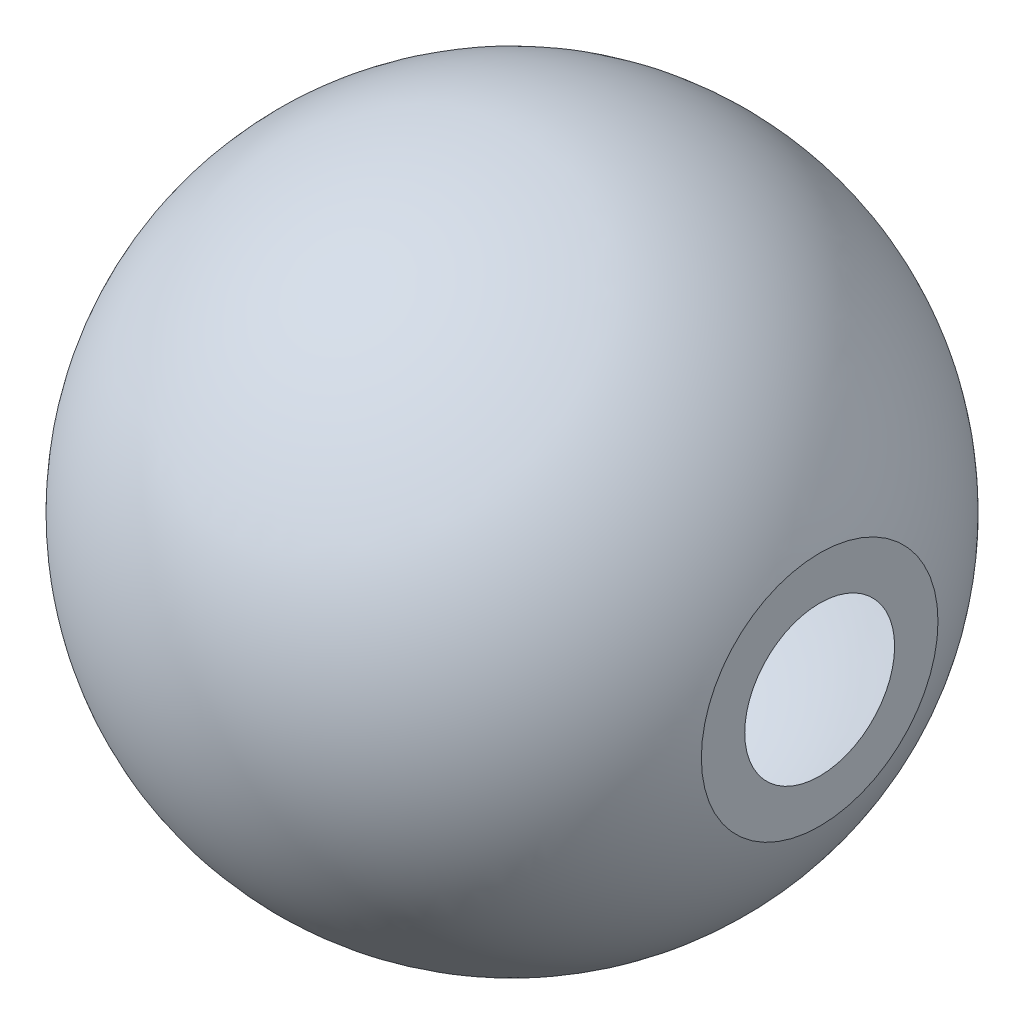
ISO-10303-21;
HEADER;
FILE_DESCRIPTION(('STEP AP214'),'2;1');
FILE_NAME('part.step','',(''),(''),'','','');
FILE_SCHEMA(('AUTOMOTIVE_DESIGN { 1 0 10303 214 1 1 1 1 }'));
ENDSEC;
DATA;
#1=APPLICATION_CONTEXT('core data for automotive mechanical design processes');
#2=APPLICATION_PROTOCOL_DEFINITION('international standard','automotive_design',2000,#1);
#3=PRODUCT_CONTEXT('',#1,'mechanical');
#4=PRODUCT('Part','Part','',(#3));
#5=PRODUCT_RELATED_PRODUCT_CATEGORY('part','',(#4));
#6=PRODUCT_DEFINITION_FORMATION('','',#4);
#7=PRODUCT_DEFINITION_CONTEXT('part definition',#1,'design');
#8=PRODUCT_DEFINITION('design','',#6,#7);
#9=PRODUCT_DEFINITION_SHAPE('','',#8);
#10=(LENGTH_UNIT() NAMED_UNIT(*) SI_UNIT(.MILLI.,.METRE.));
#11=(NAMED_UNIT(*) PLANE_ANGLE_UNIT() SI_UNIT($,.RADIAN.));
#12=(NAMED_UNIT(*) SI_UNIT($,.STERADIAN.) SOLID_ANGLE_UNIT());
#13=UNCERTAINTY_MEASURE_WITH_UNIT(LENGTH_MEASURE(1.E-05),#10,'distance_accuracy_value','');
#14=(GEOMETRIC_REPRESENTATION_CONTEXT(3) GLOBAL_UNCERTAINTY_ASSIGNED_CONTEXT((#13)) GLOBAL_UNIT_ASSIGNED_CONTEXT((#10,
#11,#12)) REPRESENTATION_CONTEXT('',''));
#15=CARTESIAN_POINT('',(0.,0.,0.));
#16=DIRECTION('',(0.,0.,1.));
#17=DIRECTION('',(1.,0.,0.));
#18=AXIS2_PLACEMENT_3D('',#15,#16,#17);
#19=CARTESIAN_POINT('',(71.1199999999959,27.3567281239554,0.));
#20=CARTESIAN_POINT('',(70.5252286554066,28.9028247009281,0.));
#21=CARTESIAN_POINT('',(68.9641727531974,32.6343455364808,0.));
#22=CARTESIAN_POINT('',(66.0641269893842,38.387933693137,0.));
#23=CARTESIAN_POINT('',(61.2234145546767,45.7845793198829,0.));
#24=CARTESIAN_POINT('',(55.0220273994092,53.0766672002609,0.));
#25=CARTESIAN_POINT('',(47.9579883624644,59.5363495662772,0.));
#26=CARTESIAN_POINT('',(40.1420718836346,65.0627769526941,0.));
#27=CARTESIAN_POINT('',(31.6968028316821,69.5691109056816,0.));
#28=CARTESIAN_POINT('',(22.7545940748085,72.9847790457556,0.));
#29=CARTESIAN_POINT('',(13.4556468821906,75.2561930989881,0.));
#30=CARTESIAN_POINT('',(3.94149770638463,76.3482469760201,0.));
#31=CARTESIAN_POINT('',(-5.63885249373841,76.2420377360682,0.));
#32=CARTESIAN_POINT('',(-15.1349146434232,74.937442340224,0.));
#33=CARTESIAN_POINT('',(-24.3970822423996,72.4532150616687,0.));
#34=CARTESIAN_POINT('',(-33.2753984013771,68.8290179815948,0.));
#35=CARTESIAN_POINT('',(-41.6301718098795,64.1218786772068,0.));
#36=CARTESIAN_POINT('',(-49.3299212177269,58.4058550015896,0.));
#37=CARTESIAN_POINT('',(-56.2535165690581,51.7709297690765,0.));
#38=CARTESIAN_POINT('',(-62.2919801656869,44.3214442621087,0.));
#39=CARTESIAN_POINT('',(-67.3503338110583,36.1749100691789,0.));
#40=CARTESIAN_POINT('',(-71.3777833787628,27.396058010348,0.));
#41=CARTESIAN_POINT('',(-74.5491842292841,17.2684181924227,0.));
#42=CARTESIAN_POINT('',(-75.8605033329186,9.14250788263846,0.));
#43=CARTESIAN_POINT('',(-76.1997487358967,3.34987545674985,0.));
#44=CARTESIAN_POINT('',(-76.2,0.,0.));
#45=B_SPLINE_CURVE_WITH_KNOTS('',4,(#19,#20,#21,#22,#23,#24,#25,#26,#27,#28,#29,#30,#31,#32,#33,
#34,#35,#36,#37,#38,#39,#40,#41,#42,#43,#44),.UNSPECIFIED.,.F.,.F.,(5,1,1,1,1,1,1,1,1,1,1,1,1,1,
1,1,1,1,1,1,1,1,5),(0.,0.0276819520568955,0.0675634033379601,0.10744529636154,0.147327049344355,
0.187208978166871,0.227091077432917,0.266973109884636,0.30685508855019,0.346737077524334,
0.386619105190738,0.426572381162427,0.466525619790481,0.506478837543788,0.546432106716508,
0.586385523333946,0.626338868942733,0.666291714997551,0.706244656647787,0.746196953767944,
0.786147885425987,0.827251267360999,0.883114119302127),.UNSPECIFIED.);
#46=CARTESIAN_POINT('',(-76.2,0.,0.));
#47=DIRECTION('',(-1.,-1.59124565376109E-13,0.));
#48=AXIS1_PLACEMENT('',#46,#47);
#49=SURFACE_OF_REVOLUTION('',#45,#48);
#50=CARTESIAN_POINT('',(-76.2,0.,0.));
#51=VERTEX_POINT('',#50);
#52=VERTEX_LOOP('',#51);
#53=FACE_BOUND('',#52,.T.);
#54=CARTESIAN_POINT('',(71.1200000000028,2.34422309712088E-11,0.));
#55=DIRECTION('',(-1.,-1.59124565376109E-13,0.));
#56=DIRECTION('',(1.59124565376109E-13,-1.,0.));
#57=AXIS2_PLACEMENT_3D('',#54,#55,#56);
#58=CIRCLE('',#57,27.3567281239288);
#59=CARTESIAN_POINT('',(71.1200000000072,-27.3567281239053,0.));
#60=VERTEX_POINT('',#59);
#61=EDGE_CURVE('E44',#60,#60,#58,.T.);
#62=ORIENTED_EDGE('',*,*,#61,.T.);
#63=EDGE_LOOP('',(#62));
#64=FACE_BOUND('',#63,.T.);
#65=ADVANCED_FACE('F37',(#53,#64),#49,.T.);
#66=CARTESIAN_POINT('',(0.,0.,0.));
#67=DIRECTION('',(-1.,-1.59124565376109E-13,0.));
#68=DIRECTION('',(-1.59124565376109E-13,1.,0.));
#69=AXIS2_PLACEMENT_3D('',#66,#67,#68);
#70=SPHERICAL_SURFACE('',#69,73.2);
#71=CARTESIAN_POINT('',(71.1200000000028,2.34422309712088E-11,0.));
#72=DIRECTION('',(-1.,-1.59124565376109E-13,0.));
#73=DIRECTION('',(1.59124565376109E-13,-1.,0.));
#74=AXIS2_PLACEMENT_3D('',#71,#72,#73);
#75=CIRCLE('',#74,17.325865057745);
#76=CARTESIAN_POINT('',(71.1200000000055,-17.3258650577215,0.));
#77=VERTEX_POINT('',#76);
#78=EDGE_CURVE('E11',#77,#77,#75,.T.);
#79=ORIENTED_EDGE('',*,*,#78,.F.);
#80=EDGE_LOOP('',(#79));
#81=FACE_BOUND('',#80,.T.);
#82=ADVANCED_FACE('F49',(#81),#70,.F.);
#83=CARTESIAN_POINT('',(71.12,17.3258650577684,0.));
#84=DIRECTION('',(-1.,-1.59124565376109E-13,0.));
#85=DIRECTION('',(1.59124565376109E-13,-1.,0.));
#86=AXIS2_PLACEMENT_3D('',#83,#84,#85);
#87=PLANE('',#86);
#88=ORIENTED_EDGE('',*,*,#61,.F.);
#89=EDGE_LOOP('',(#88));
#90=FACE_BOUND('',#89,.T.);
#91=ORIENTED_EDGE('',*,*,#78,.T.);
#92=EDGE_LOOP('',(#91));
#93=FACE_BOUND('',#92,.T.);
#94=ADVANCED_FACE('F59',(#90,#93),#87,.F.);
#95=CLOSED_SHELL('',(#65,#82,#94));
#96=MANIFOLD_SOLID_BREP('B2',#95);
#97=ADVANCED_BREP_SHAPE_REPRESENTATION('',(#18,#96),#14);
#98=SHAPE_DEFINITION_REPRESENTATION(#9,#97);
ENDSEC;
END-ISO-10303-21;
